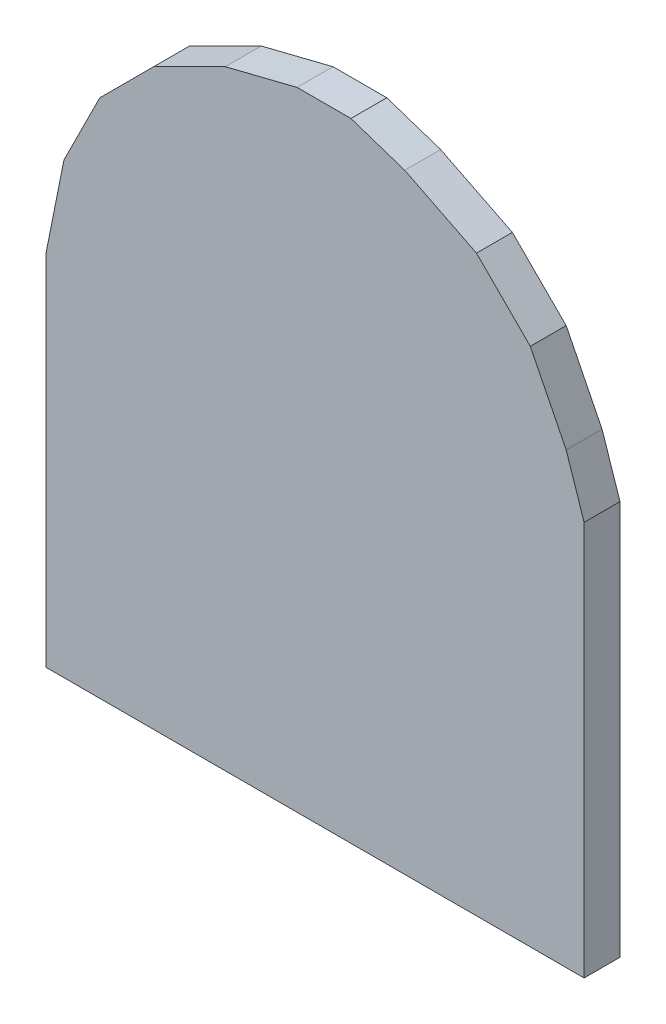
ISO-10303-21;
HEADER;
FILE_DESCRIPTION(('STEP AP214'),'2;1');
FILE_NAME('part.step','',(''),(''),'','','');
FILE_SCHEMA(('AUTOMOTIVE_DESIGN { 1 0 10303 214 1 1 1 1 }'));
ENDSEC;
DATA;
#1=APPLICATION_CONTEXT('core data for automotive mechanical design processes');
#2=APPLICATION_PROTOCOL_DEFINITION('international standard','automotive_design',2000,#1);
#3=PRODUCT_CONTEXT('',#1,'mechanical');
#4=PRODUCT('Part','Part','',(#3));
#5=PRODUCT_RELATED_PRODUCT_CATEGORY('part','',(#4));
#6=PRODUCT_DEFINITION_FORMATION('','',#4);
#7=PRODUCT_DEFINITION_CONTEXT('part definition',#1,'design');
#8=PRODUCT_DEFINITION('design','',#6,#7);
#9=PRODUCT_DEFINITION_SHAPE('','',#8);
#10=(LENGTH_UNIT() NAMED_UNIT(*) SI_UNIT(.MILLI.,.METRE.));
#11=(NAMED_UNIT(*) PLANE_ANGLE_UNIT() SI_UNIT($,.RADIAN.));
#12=(NAMED_UNIT(*) SI_UNIT($,.STERADIAN.) SOLID_ANGLE_UNIT());
#13=UNCERTAINTY_MEASURE_WITH_UNIT(LENGTH_MEASURE(1.E-05),#10,'distance_accuracy_value','');
#14=(GEOMETRIC_REPRESENTATION_CONTEXT(3) GLOBAL_UNCERTAINTY_ASSIGNED_CONTEXT((#13)) GLOBAL_UNIT_ASSIGNED_CONTEXT((#10,
#11,#12)) REPRESENTATION_CONTEXT('',''));
#15=CARTESIAN_POINT('',(0.,0.,0.));
#16=DIRECTION('',(0.,0.,1.));
#17=DIRECTION('',(1.,0.,0.));
#18=AXIS2_PLACEMENT_3D('',#15,#16,#17);
#19=CARTESIAN_POINT('',(-0.1499997,-0.17499838,0.02));
#20=DIRECTION('',(0.,0.,1.));
#21=DIRECTION('',(1.,0.,0.));
#22=AXIS2_PLACEMENT_3D('',#19,#20,#21);
#23=PLANE('',#22);
#24=DIRECTION('',(-0.196068236745948,-0.98059025415274,0.));
#25=VECTOR('',#24,1.);
#26=CARTESIAN_POINT('',(-0.1499997,0.02500121999999,0.02));
#27=LINE('',#26,#25);
#28=CARTESIAN_POINT('',(-0.1499997,0.0250012199999903,0.02));
#29=VERTEX_POINT('',#28);
#30=CARTESIAN_POINT('',(-0.14000226,0.0750011200000001,0.02));
#31=VERTEX_POINT('',#30);
#32=EDGE_CURVE('E177',#29,#31,#27,.F.);
#33=ORIENTED_EDGE('',*,*,#32,.F.);
#34=DIRECTION('',(0.,1.,0.));
#35=VECTOR('',#34,1.);
#36=CARTESIAN_POINT('',(-0.1499997,-0.17499838,0.02));
#37=LINE('',#36,#35);
#38=CARTESIAN_POINT('',(-0.1499997,-0.17499838,0.02));
#39=VERTEX_POINT('',#38);
#40=EDGE_CURVE('E130',#39,#29,#37,.T.);
#41=ORIENTED_EDGE('',*,*,#40,.F.);
#42=DIRECTION('',(1.,0.,0.));
#43=VECTOR('',#42,1.);
#44=CARTESIAN_POINT('',(0.1499997,-0.17499838,0.02));
#45=LINE('',#44,#43);
#46=CARTESIAN_POINT('',(0.1499997,-0.17499838,0.02));
#47=VERTEX_POINT('',#46);
#48=EDGE_CURVE('E20',#47,#39,#45,.F.);
#49=ORIENTED_EDGE('',*,*,#48,.F.);
#50=DIRECTION('',(0.,1.,0.));
#51=VECTOR('',#50,1.);
#52=CARTESIAN_POINT('',(0.1499997,0.04500118,0.02));
#53=LINE('',#52,#51);
#54=CARTESIAN_POINT('',(0.149999700000002,0.0450011800000006,0.02));
#55=VERTEX_POINT('',#54);
#56=EDGE_CURVE('E119',#55,#47,#53,.F.);
#57=ORIENTED_EDGE('',*,*,#56,.F.);
#58=DIRECTION('',(-0.316227766017138,0.948683298050414,0.));
#59=VECTOR('',#58,1.);
#60=CARTESIAN_POINT('',(0.13999972,0.07500112,0.02));
#61=LINE('',#60,#59);
#62=CARTESIAN_POINT('',(0.13999972,0.0750011200000003,0.02));
#63=VERTEX_POINT('',#62);
#64=EDGE_CURVE('E114',#63,#55,#61,.F.);
#65=ORIENTED_EDGE('',*,*,#64,.F.);
#66=DIRECTION('',(-0.447213595499958,0.894427190999916,0.));
#67=VECTOR('',#66,1.);
#68=CARTESIAN_POINT('',(0.11999976,0.11500104,0.02));
#69=LINE('',#68,#67);
#70=CARTESIAN_POINT('',(0.11999976,0.11500104,0.02));
#71=VERTEX_POINT('',#70);
#72=EDGE_CURVE('E141',#71,#63,#69,.F.);
#73=ORIENTED_EDGE('',*,*,#72,.F.);
#74=DIRECTION('',(-0.707106781186548,0.707106781186548,0.));
#75=VECTOR('',#74,1.);
#76=CARTESIAN_POINT('',(0.08999982,0.14500098,0.02));
#77=LINE('',#76,#75);
#78=CARTESIAN_POINT('',(0.0899998199999999,0.14500098,0.02));
#79=VERTEX_POINT('',#78);
#80=EDGE_CURVE('E145',#79,#71,#77,.F.);
#81=ORIENTED_EDGE('',*,*,#80,.F.);
#82=DIRECTION('',(-0.894427190999916,0.447213595499958,0.));
#83=VECTOR('',#82,1.);
#84=CARTESIAN_POINT('',(0.0499999,0.16500094,0.02));
#85=LINE('',#84,#83);
#86=CARTESIAN_POINT('',(0.0499998999999997,0.165000939999999,0.02));
#87=VERTEX_POINT('',#86);
#88=EDGE_CURVE('E149',#87,#79,#85,.F.);
#89=ORIENTED_EDGE('',*,*,#88,.F.);
#90=DIRECTION('',(-0.948683298050514,0.316227766016838,0.));
#91=VECTOR('',#90,1.);
#92=CARTESIAN_POINT('',(0.01999995999999,0.17500092,0.02));
#93=LINE('',#92,#91);
#94=CARTESIAN_POINT('',(0.0199999599999899,0.17500092,0.02));
#95=VERTEX_POINT('',#94);
#96=EDGE_CURVE('E153',#95,#87,#93,.F.);
#97=ORIENTED_EDGE('',*,*,#96,.F.);
#98=DIRECTION('',(1.,0.,0.));
#99=VECTOR('',#98,1.);
#100=CARTESIAN_POINT('',(-0.009999980000003,0.17500092,0.02));
#101=LINE('',#100,#99);
#102=CARTESIAN_POINT('',(-0.00999998000000201,0.175000919999997,0.02));
#103=VERTEX_POINT('',#102);
#104=EDGE_CURVE('E157',#103,#95,#101,.T.);
#105=ORIENTED_EDGE('',*,*,#104,.F.);
#106=DIRECTION('',(-0.970142500145391,-0.242535625036098,0.));
#107=VECTOR('',#106,1.);
#108=CARTESIAN_POINT('',(-0.0499999,0.16500094,0.02));
#109=LINE('',#108,#107);
#110=CARTESIAN_POINT('',(-0.0499999000000002,0.16500094,0.02));
#111=VERTEX_POINT('',#110);
#112=EDGE_CURVE('E161',#111,#103,#109,.F.);
#113=ORIENTED_EDGE('',*,*,#112,.F.);
#114=DIRECTION('',(-0.894427190999916,-0.447213595499958,0.));
#115=VECTOR('',#114,1.);
#116=CARTESIAN_POINT('',(-0.08999982,0.14500098,0.02));
#117=LINE('',#116,#115);
#118=CARTESIAN_POINT('',(-0.0899998199999973,0.145000979999997,0.02));
#119=VERTEX_POINT('',#118);
#120=EDGE_CURVE('E165',#119,#111,#117,.F.);
#121=ORIENTED_EDGE('',*,*,#120,.F.);
#122=DIRECTION('',(-0.707136713532992,-0.707076847572992,0.));
#123=VECTOR('',#122,1.);
#124=CARTESIAN_POINT('',(-0.1200023,0.11500104,0.02));
#125=LINE('',#124,#123);
#126=CARTESIAN_POINT('',(-0.1200023,0.11500104,0.02));
#127=VERTEX_POINT('',#126);
#128=EDGE_CURVE('E169',#127,#119,#125,.F.);
#129=ORIENTED_EDGE('',*,*,#128,.F.);
#130=DIRECTION('',(-0.447213595499958,-0.894427190999916,0.));
#131=VECTOR('',#130,1.);
#132=CARTESIAN_POINT('',(-0.14000226,0.07500112,0.02));
#133=LINE('',#132,#131);
#134=EDGE_CURVE('E173',#31,#127,#133,.F.);
#135=ORIENTED_EDGE('',*,*,#134,.F.);
#136=EDGE_LOOP('',(#33,#41,#49,#57,#65,#73,#81,#89,#97,#105,#113,#121,#129,#135));
#137=FACE_BOUND('',#136,.T.);
#138=ADVANCED_FACE('F17',(#137),#23,.T.);
#139=CARTESIAN_POINT('',(0.1499997,-0.17499838,0.));
#140=DIRECTION('',(0.,-1.,0.));
#141=DIRECTION('',(0.,0.,-1.));
#142=AXIS2_PLACEMENT_3D('',#139,#140,#141);
#143=PLANE('',#142);
#144=DIRECTION('',(0.,0.,1.));
#145=VECTOR('',#144,1.);
#146=CARTESIAN_POINT('',(-0.1499997,-0.17499838,0.));
#147=LINE('',#146,#145);
#148=CARTESIAN_POINT('',(-0.1499997,-0.17499838,0.));
#149=VERTEX_POINT('',#148);
#150=EDGE_CURVE('E181',#149,#39,#147,.T.);
#151=ORIENTED_EDGE('',*,*,#150,.F.);
#152=DIRECTION('',(1.,0.,0.));
#153=VECTOR('',#152,1.);
#154=CARTESIAN_POINT('',(-0.1499997,-0.17499838,0.));
#155=LINE('',#154,#153);
#156=CARTESIAN_POINT('',(0.1499997,-0.17499838,0.));
#157=VERTEX_POINT('',#156);
#158=EDGE_CURVE('E136',#149,#157,#155,.T.);
#159=ORIENTED_EDGE('',*,*,#158,.T.);
#160=DIRECTION('',(0.,0.,-1.));
#161=VECTOR('',#160,1.);
#162=CARTESIAN_POINT('',(0.1499997,-0.17499838,0.));
#163=LINE('',#162,#161);
#164=EDGE_CURVE('E124',#47,#157,#163,.T.);
#165=ORIENTED_EDGE('',*,*,#164,.F.);
#166=ORIENTED_EDGE('',*,*,#48,.T.);
#167=EDGE_LOOP('',(#151,#159,#165,#166));
#168=FACE_BOUND('',#167,.T.);
#169=ADVANCED_FACE('F135',(#168),#143,.T.);
#170=CARTESIAN_POINT('',(0.1499997,0.04500118,0.));
#171=DIRECTION('',(1.,0.,0.));
#172=DIRECTION('',(0.,0.,-1.));
#173=AXIS2_PLACEMENT_3D('',#170,#171,#172);
#174=PLANE('',#173);
#175=ORIENTED_EDGE('',*,*,#164,.T.);
#176=DIRECTION('',(0.,1.,0.));
#177=VECTOR('',#176,1.);
#178=CARTESIAN_POINT('',(0.1499997,-0.17499838,0.));
#179=LINE('',#178,#177);
#180=CARTESIAN_POINT('',(0.149999700000002,0.0450011800000007,0.));
#181=VERTEX_POINT('',#180);
#182=EDGE_CURVE('E186',#157,#181,#179,.T.);
#183=ORIENTED_EDGE('',*,*,#182,.T.);
#184=DIRECTION('',(0.,0.,1.));
#185=VECTOR('',#184,1.);
#186=CARTESIAN_POINT('',(0.149999700000009,0.0450011800000032,0.));
#187=LINE('',#186,#185);
#188=EDGE_CURVE('E126',#55,#181,#187,.F.);
#189=ORIENTED_EDGE('',*,*,#188,.F.);
#190=ORIENTED_EDGE('',*,*,#56,.T.);
#191=EDGE_LOOP('',(#175,#183,#189,#190));
#192=FACE_BOUND('',#191,.T.);
#193=ADVANCED_FACE('F121',(#192),#174,.T.);
#194=CARTESIAN_POINT('',(0.13999972,0.07500112,0.));
#195=DIRECTION('',(0.948683298050414,0.316227766017138,0.));
#196=DIRECTION('',(-0.316227766017138,0.948683298050414,0.));
#197=AXIS2_PLACEMENT_3D('',#194,#195,#196);
#198=PLANE('',#197);
#199=ORIENTED_EDGE('',*,*,#188,.T.);
#200=DIRECTION('',(-0.316227766016838,0.948683298050514,0.));
#201=VECTOR('',#200,1.);
#202=CARTESIAN_POINT('',(0.1499997,0.04500118,0.));
#203=LINE('',#202,#201);
#204=CARTESIAN_POINT('',(0.13999972,0.0750011200000002,0.));
#205=VERTEX_POINT('',#204);
#206=EDGE_CURVE('E188',#181,#205,#203,.T.);
#207=ORIENTED_EDGE('',*,*,#206,.T.);
#208=DIRECTION('',(0.,0.,1.));
#209=VECTOR('',#208,1.);
#210=CARTESIAN_POINT('',(0.13999972,0.07500112,0.));
#211=LINE('',#210,#209);
#212=EDGE_CURVE('E143',#63,#205,#211,.F.);
#213=ORIENTED_EDGE('',*,*,#212,.F.);
#214=ORIENTED_EDGE('',*,*,#64,.T.);
#215=EDGE_LOOP('',(#199,#207,#213,#214));
#216=FACE_BOUND('',#215,.T.);
#217=ADVANCED_FACE('F270',(#216),#198,.T.);
#218=CARTESIAN_POINT('',(0.11999976,0.11500104,0.));
#219=DIRECTION('',(0.894427190999916,0.447213595499958,0.));
#220=DIRECTION('',(-0.447213595499958,0.894427190999916,0.));
#221=AXIS2_PLACEMENT_3D('',#218,#219,#220);
#222=PLANE('',#221);
#223=ORIENTED_EDGE('',*,*,#212,.T.);
#224=DIRECTION('',(-0.447213595499958,0.894427190999916,0.));
#225=VECTOR('',#224,1.);
#226=CARTESIAN_POINT('',(0.13999972,0.07500112,0.));
#227=LINE('',#226,#225);
#228=CARTESIAN_POINT('',(0.11999976,0.11500104,0.));
#229=VERTEX_POINT('',#228);
#230=EDGE_CURVE('E191',#205,#229,#227,.T.);
#231=ORIENTED_EDGE('',*,*,#230,.T.);
#232=DIRECTION('',(0.,0.,1.));
#233=VECTOR('',#232,1.);
#234=CARTESIAN_POINT('',(0.11999976,0.11500104,0.));
#235=LINE('',#234,#233);
#236=EDGE_CURVE('E147',#71,#229,#235,.F.);
#237=ORIENTED_EDGE('',*,*,#236,.F.);
#238=ORIENTED_EDGE('',*,*,#72,.T.);
#239=EDGE_LOOP('',(#223,#231,#237,#238));
#240=FACE_BOUND('',#239,.T.);
#241=ADVANCED_FACE('F269',(#240),#222,.T.);
#242=CARTESIAN_POINT('',(0.08999982,0.14500098,0.));
#243=DIRECTION('',(0.707106781186548,0.707106781186548,0.));
#244=DIRECTION('',(-0.707106781186548,0.707106781186548,0.));
#245=AXIS2_PLACEMENT_3D('',#242,#243,#244);
#246=PLANE('',#245);
#247=ORIENTED_EDGE('',*,*,#236,.T.);
#248=DIRECTION('',(-0.707106781186548,0.707106781186547,0.));
#249=VECTOR('',#248,1.);
#250=CARTESIAN_POINT('',(0.11999976,0.11500104,0.));
#251=LINE('',#250,#249);
#252=CARTESIAN_POINT('',(0.08999982,0.14500098,0.));
#253=VERTEX_POINT('',#252);
#254=EDGE_CURVE('E194',#229,#253,#251,.T.);
#255=ORIENTED_EDGE('',*,*,#254,.T.);
#256=DIRECTION('',(0.,0.,1.));
#257=VECTOR('',#256,1.);
#258=CARTESIAN_POINT('',(0.08999982,0.14500098,0.));
#259=LINE('',#258,#257);
#260=EDGE_CURVE('E151',#79,#253,#259,.F.);
#261=ORIENTED_EDGE('',*,*,#260,.F.);
#262=ORIENTED_EDGE('',*,*,#80,.T.);
#263=EDGE_LOOP('',(#247,#255,#261,#262));
#264=FACE_BOUND('',#263,.T.);
#265=ADVANCED_FACE('F263',(#264),#246,.T.);
#266=CARTESIAN_POINT('',(0.0499999,0.16500094,0.));
#267=DIRECTION('',(0.447213595499958,0.894427190999916,0.));
#268=DIRECTION('',(-0.894427190999916,0.447213595499958,0.));
#269=AXIS2_PLACEMENT_3D('',#266,#267,#268);
#270=PLANE('',#269);
#271=ORIENTED_EDGE('',*,*,#260,.T.);
#272=DIRECTION('',(-0.894427190999916,0.447213595499958,0.));
#273=VECTOR('',#272,1.);
#274=CARTESIAN_POINT('',(0.08999982,0.14500098,0.));
#275=LINE('',#274,#273);
#276=CARTESIAN_POINT('',(0.0499998999999998,0.165000939999999,0.));
#277=VERTEX_POINT('',#276);
#278=EDGE_CURVE('E197',#253,#277,#275,.T.);
#279=ORIENTED_EDGE('',*,*,#278,.T.);
#280=DIRECTION('',(0.,0.,1.));
#281=VECTOR('',#280,1.);
#282=CARTESIAN_POINT('',(0.049999899999999,0.165000939999997,0.));
#283=LINE('',#282,#281);
#284=EDGE_CURVE('E155',#87,#277,#283,.F.);
#285=ORIENTED_EDGE('',*,*,#284,.F.);
#286=ORIENTED_EDGE('',*,*,#88,.T.);
#287=EDGE_LOOP('',(#271,#279,#285,#286));
#288=FACE_BOUND('',#287,.T.);
#289=ADVANCED_FACE('F259',(#288),#270,.T.);
#290=CARTESIAN_POINT('',(0.01999995999999,0.17500092,0.));
#291=DIRECTION('',(0.316227766016838,0.948683298050514,0.));
#292=DIRECTION('',(-0.948683298050514,0.316227766016838,0.));
#293=AXIS2_PLACEMENT_3D('',#290,#291,#292);
#294=PLANE('',#293);
#295=ORIENTED_EDGE('',*,*,#284,.T.);
#296=DIRECTION('',(-0.948683298050545,0.316227766016743,0.));
#297=VECTOR('',#296,1.);
#298=CARTESIAN_POINT('',(0.0499999,0.16500094,0.));
#299=LINE('',#298,#297);
#300=CARTESIAN_POINT('',(0.01999995999999,0.17500092,0.));
#301=VERTEX_POINT('',#300);
#302=EDGE_CURVE('E200',#277,#301,#299,.T.);
#303=ORIENTED_EDGE('',*,*,#302,.T.);
#304=DIRECTION('',(0.,0.,1.));
#305=VECTOR('',#304,1.);
#306=CARTESIAN_POINT('',(0.01999995999999,0.17500092,0.));
#307=LINE('',#306,#305);
#308=EDGE_CURVE('E159',#95,#301,#307,.F.);
#309=ORIENTED_EDGE('',*,*,#308,.F.);
#310=ORIENTED_EDGE('',*,*,#96,.T.);
#311=EDGE_LOOP('',(#295,#303,#309,#310));
#312=FACE_BOUND('',#311,.T.);
#313=ADVANCED_FACE('F253',(#312),#294,.T.);
#314=CARTESIAN_POINT('',(-0.009999980000003,0.17500092,0.));
#315=DIRECTION('',(0.,1.,0.));
#316=DIRECTION('',(0.,0.,1.));
#317=AXIS2_PLACEMENT_3D('',#314,#315,#316);
#318=PLANE('',#317);
#319=ORIENTED_EDGE('',*,*,#308,.T.);
#320=DIRECTION('',(1.,0.,0.));
#321=VECTOR('',#320,1.);
#322=CARTESIAN_POINT('',(-0.1499997,0.17500092,0.));
#323=LINE('',#322,#321);
#324=CARTESIAN_POINT('',(-0.00999998000000217,0.175000919999997,0.));
#325=VERTEX_POINT('',#324);
#326=EDGE_CURVE('E203',#301,#325,#323,.F.);
#327=ORIENTED_EDGE('',*,*,#326,.T.);
#328=DIRECTION('',(0.,0.,1.));
#329=VECTOR('',#328,1.);
#330=CARTESIAN_POINT('',(-0.00999998000000038,0.17500091999999,0.));
#331=LINE('',#330,#329);
#332=EDGE_CURVE('E163',#103,#325,#331,.F.);
#333=ORIENTED_EDGE('',*,*,#332,.F.);
#334=ORIENTED_EDGE('',*,*,#104,.T.);
#335=EDGE_LOOP('',(#319,#327,#333,#334));
#336=FACE_BOUND('',#335,.T.);
#337=ADVANCED_FACE('F249',(#336),#318,.T.);
#338=CARTESIAN_POINT('',(-0.0499999,0.16500094,0.));
#339=DIRECTION('',(-0.242535625036098,0.970142500145391,0.));
#340=DIRECTION('',(-0.970142500145391,-0.242535625036098,0.));
#341=AXIS2_PLACEMENT_3D('',#338,#339,#340);
#342=PLANE('',#341);
#343=ORIENTED_EDGE('',*,*,#332,.T.);
#344=DIRECTION('',(-0.970142500145328,-0.24253562503635,0.));
#345=VECTOR('',#344,1.);
#346=CARTESIAN_POINT('',(-0.00999998000000301,0.17500092,0.));
#347=LINE('',#346,#345);
#348=CARTESIAN_POINT('',(-0.0499999000000001,0.16500094,0.));
#349=VERTEX_POINT('',#348);
#350=EDGE_CURVE('E206',#325,#349,#347,.T.);
#351=ORIENTED_EDGE('',*,*,#350,.T.);
#352=DIRECTION('',(0.,0.,1.));
#353=VECTOR('',#352,1.);
#354=CARTESIAN_POINT('',(-0.0499999,0.16500094,0.));
#355=LINE('',#354,#353);
#356=EDGE_CURVE('E167',#111,#349,#355,.F.);
#357=ORIENTED_EDGE('',*,*,#356,.F.);
#358=ORIENTED_EDGE('',*,*,#112,.T.);
#359=EDGE_LOOP('',(#343,#351,#357,#358));
#360=FACE_BOUND('',#359,.T.);
#361=ADVANCED_FACE('F243',(#360),#342,.T.);
#362=CARTESIAN_POINT('',(-0.08999982,0.14500098,0.));
#363=DIRECTION('',(-0.447213595499958,0.894427190999916,0.));
#364=DIRECTION('',(-0.894427190999916,-0.447213595499958,0.));
#365=AXIS2_PLACEMENT_3D('',#362,#363,#364);
#366=PLANE('',#365);
#367=ORIENTED_EDGE('',*,*,#356,.T.);
#368=DIRECTION('',(-0.894427190999916,-0.447213595499958,0.));
#369=VECTOR('',#368,1.);
#370=CARTESIAN_POINT('',(-0.0499999,0.16500094,0.));
#371=LINE('',#370,#369);
#372=CARTESIAN_POINT('',(-0.0899998199999973,0.145000979999997,0.));
#373=VERTEX_POINT('',#372);
#374=EDGE_CURVE('E209',#349,#373,#371,.T.);
#375=ORIENTED_EDGE('',*,*,#374,.T.);
#376=DIRECTION('',(0.,0.,1.));
#377=VECTOR('',#376,1.);
#378=CARTESIAN_POINT('',(-0.0899998199999892,0.145000979999989,0.));
#379=LINE('',#378,#377);
#380=EDGE_CURVE('E171',#119,#373,#379,.F.);
#381=ORIENTED_EDGE('',*,*,#380,.F.);
#382=ORIENTED_EDGE('',*,*,#120,.T.);
#383=EDGE_LOOP('',(#367,#375,#381,#382));
#384=FACE_BOUND('',#383,.T.);
#385=ADVANCED_FACE('F239',(#384),#366,.T.);
#386=CARTESIAN_POINT('',(-0.1200023,0.11500104,0.));
#387=DIRECTION('',(-0.707076847572992,0.707136713532992,0.));
#388=DIRECTION('',(-0.707136713532992,-0.707076847572992,0.));
#389=AXIS2_PLACEMENT_3D('',#386,#387,#388);
#390=PLANE('',#389);
#391=ORIENTED_EDGE('',*,*,#380,.T.);
#392=DIRECTION('',(-0.707136713532739,-0.707076847573245,0.));
#393=VECTOR('',#392,1.);
#394=CARTESIAN_POINT('',(-0.08999982,0.14500098,0.));
#395=LINE('',#394,#393);
#396=CARTESIAN_POINT('',(-0.1200023,0.11500104,0.));
#397=VERTEX_POINT('',#396);
#398=EDGE_CURVE('E212',#373,#397,#395,.T.);
#399=ORIENTED_EDGE('',*,*,#398,.T.);
#400=DIRECTION('',(0.,0.,1.));
#401=VECTOR('',#400,1.);
#402=CARTESIAN_POINT('',(-0.1200023,0.11500104,0.));
#403=LINE('',#402,#401);
#404=EDGE_CURVE('E175',#127,#397,#403,.F.);
#405=ORIENTED_EDGE('',*,*,#404,.F.);
#406=ORIENTED_EDGE('',*,*,#128,.T.);
#407=EDGE_LOOP('',(#391,#399,#405,#406));
#408=FACE_BOUND('',#407,.T.);
#409=ADVANCED_FACE('F233',(#408),#390,.T.);
#410=CARTESIAN_POINT('',(-0.14000226,0.07500112,0.));
#411=DIRECTION('',(-0.894427190999916,0.447213595499958,0.));
#412=DIRECTION('',(-0.447213595499958,-0.894427190999916,0.));
#413=AXIS2_PLACEMENT_3D('',#410,#411,#412);
#414=PLANE('',#413);
#415=ORIENTED_EDGE('',*,*,#404,.T.);
#416=DIRECTION('',(-0.447213595499957,-0.894427190999916,0.));
#417=VECTOR('',#416,1.);
#418=CARTESIAN_POINT('',(-0.1200023,0.11500104,0.));
#419=LINE('',#418,#417);
#420=CARTESIAN_POINT('',(-0.14000226,0.0750011200000001,0.));
#421=VERTEX_POINT('',#420);
#422=EDGE_CURVE('E215',#397,#421,#419,.T.);
#423=ORIENTED_EDGE('',*,*,#422,.T.);
#424=DIRECTION('',(0.,0.,1.));
#425=VECTOR('',#424,1.);
#426=CARTESIAN_POINT('',(-0.140002260000001,0.0750011200000002,0.));
#427=LINE('',#426,#425);
#428=EDGE_CURVE('E179',#31,#421,#427,.F.);
#429=ORIENTED_EDGE('',*,*,#428,.F.);
#430=ORIENTED_EDGE('',*,*,#134,.T.);
#431=EDGE_LOOP('',(#415,#423,#429,#430));
#432=FACE_BOUND('',#431,.T.);
#433=ADVANCED_FACE('F228',(#432),#414,.T.);
#434=CARTESIAN_POINT('',(-0.1499997,0.02500121999999,0.));
#435=DIRECTION('',(-0.98059025415274,0.196068236745948,0.));
#436=DIRECTION('',(-0.196068236745948,-0.98059025415274,0.));
#437=AXIS2_PLACEMENT_3D('',#434,#435,#436);
#438=PLANE('',#437);
#439=ORIENTED_EDGE('',*,*,#428,.T.);
#440=DIRECTION('',(-0.196068236745969,-0.980590254152736,0.));
#441=VECTOR('',#440,1.);
#442=CARTESIAN_POINT('',(-0.14000226,0.07500112,0.));
#443=LINE('',#442,#441);
#444=CARTESIAN_POINT('',(-0.1499997,0.0250012199999901,0.));
#445=VERTEX_POINT('',#444);
#446=EDGE_CURVE('E26',#421,#445,#443,.T.);
#447=ORIENTED_EDGE('',*,*,#446,.T.);
#448=DIRECTION('',(0.,0.,1.));
#449=VECTOR('',#448,1.);
#450=CARTESIAN_POINT('',(-0.1499997,0.02500121999999,0.));
#451=LINE('',#450,#449);
#452=EDGE_CURVE('E34',#29,#445,#451,.F.);
#453=ORIENTED_EDGE('',*,*,#452,.F.);
#454=ORIENTED_EDGE('',*,*,#32,.T.);
#455=EDGE_LOOP('',(#439,#447,#453,#454));
#456=FACE_BOUND('',#455,.T.);
#457=ADVANCED_FACE('F221',(#456),#438,.T.);
#458=CARTESIAN_POINT('',(-0.1499997,-0.17499838,0.));
#459=DIRECTION('',(-1.,0.,0.));
#460=DIRECTION('',(0.,0.,1.));
#461=AXIS2_PLACEMENT_3D('',#458,#459,#460);
#462=PLANE('',#461);
#463=ORIENTED_EDGE('',*,*,#452,.T.);
#464=DIRECTION('',(0.,1.,0.));
#465=VECTOR('',#464,1.);
#466=CARTESIAN_POINT('',(-0.1499997,-0.17499838,0.));
#467=LINE('',#466,#465);
#468=EDGE_CURVE('E11',#445,#149,#467,.F.);
#469=ORIENTED_EDGE('',*,*,#468,.T.);
#470=ORIENTED_EDGE('',*,*,#150,.T.);
#471=ORIENTED_EDGE('',*,*,#40,.T.);
#472=EDGE_LOOP('',(#463,#469,#470,#471));
#473=FACE_BOUND('',#472,.T.);
#474=ADVANCED_FACE('F271',(#473),#462,.T.);
#475=CARTESIAN_POINT('',(-0.1499997,-0.17499838,0.));
#476=DIRECTION('',(0.,0.,1.));
#477=DIRECTION('',(1.,0.,0.));
#478=AXIS2_PLACEMENT_3D('',#475,#476,#477);
#479=PLANE('',#478);
#480=ORIENTED_EDGE('',*,*,#446,.F.);
#481=ORIENTED_EDGE('',*,*,#422,.F.);
#482=ORIENTED_EDGE('',*,*,#398,.F.);
#483=ORIENTED_EDGE('',*,*,#374,.F.);
#484=ORIENTED_EDGE('',*,*,#350,.F.);
#485=ORIENTED_EDGE('',*,*,#326,.F.);
#486=ORIENTED_EDGE('',*,*,#302,.F.);
#487=ORIENTED_EDGE('',*,*,#278,.F.);
#488=ORIENTED_EDGE('',*,*,#254,.F.);
#489=ORIENTED_EDGE('',*,*,#230,.F.);
#490=ORIENTED_EDGE('',*,*,#206,.F.);
#491=ORIENTED_EDGE('',*,*,#182,.F.);
#492=ORIENTED_EDGE('',*,*,#158,.F.);
#493=ORIENTED_EDGE('',*,*,#468,.F.);
#494=EDGE_LOOP('',(#480,#481,#482,#483,#484,#485,#486,#487,#488,#489,#490,#491,#492,#493));
#495=FACE_BOUND('',#494,.T.);
#496=ADVANCED_FACE('F225',(#495),#479,.F.);
#497=CLOSED_SHELL('',(#138,#169,#193,#217,#241,#265,#289,#313,#337,#361,#385,#409,#433,#457,
#474,#496));
#498=MANIFOLD_SOLID_BREP('B1',#497);
#499=ADVANCED_BREP_SHAPE_REPRESENTATION('',(#18,#498),#14);
#500=SHAPE_DEFINITION_REPRESENTATION(#9,#499);
ENDSEC;
END-ISO-10303-21;
